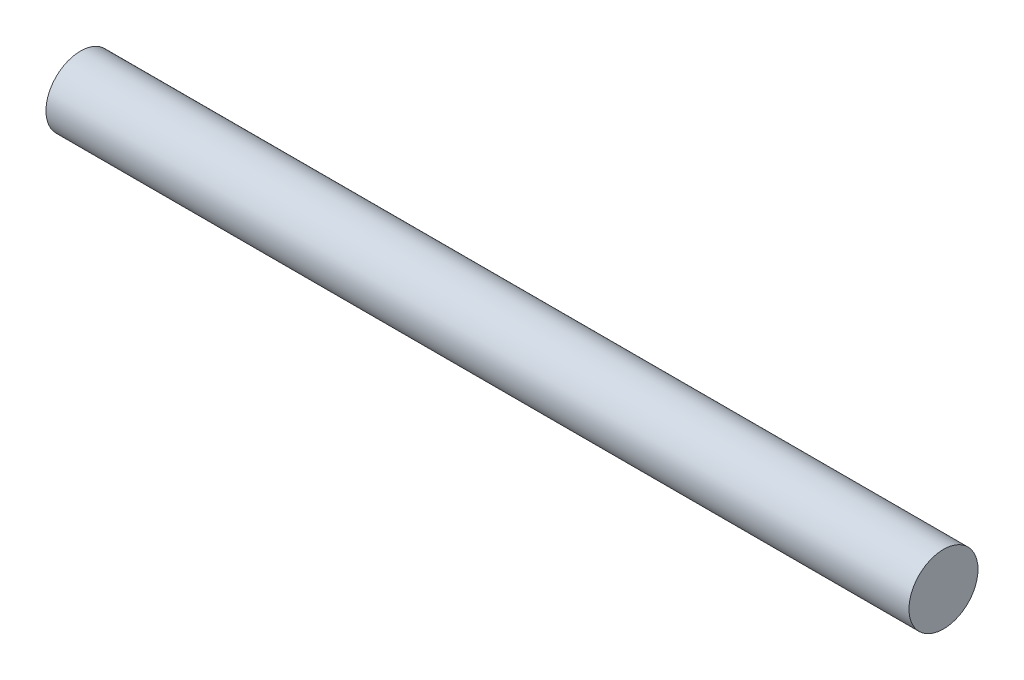
ISO-10303-21;
HEADER;
FILE_DESCRIPTION(('STEP AP214'),'2;1');
FILE_NAME('part.step','',(''),(''),'','','');
FILE_SCHEMA(('AUTOMOTIVE_DESIGN { 1 0 10303 214 1 1 1 1 }'));
ENDSEC;
DATA;
#1=APPLICATION_CONTEXT('core data for automotive mechanical design processes');
#2=APPLICATION_PROTOCOL_DEFINITION('international standard','automotive_design',2000,#1);
#3=PRODUCT_CONTEXT('',#1,'mechanical');
#4=PRODUCT('Part','Part','',(#3));
#5=PRODUCT_RELATED_PRODUCT_CATEGORY('part','',(#4));
#6=PRODUCT_DEFINITION_FORMATION('','',#4);
#7=PRODUCT_DEFINITION_CONTEXT('part definition',#1,'design');
#8=PRODUCT_DEFINITION('design','',#6,#7);
#9=PRODUCT_DEFINITION_SHAPE('','',#8);
#10=(LENGTH_UNIT() NAMED_UNIT(*) SI_UNIT(.MILLI.,.METRE.));
#11=(NAMED_UNIT(*) PLANE_ANGLE_UNIT() SI_UNIT($,.RADIAN.));
#12=(NAMED_UNIT(*) SI_UNIT($,.STERADIAN.) SOLID_ANGLE_UNIT());
#13=UNCERTAINTY_MEASURE_WITH_UNIT(LENGTH_MEASURE(1.E-05),#10,'distance_accuracy_value','');
#14=(GEOMETRIC_REPRESENTATION_CONTEXT(3) GLOBAL_UNCERTAINTY_ASSIGNED_CONTEXT((#13)) GLOBAL_UNIT_ASSIGNED_CONTEXT((#10,
#11,#12)) REPRESENTATION_CONTEXT('',''));
#15=CARTESIAN_POINT('',(0.,0.,0.));
#16=DIRECTION('',(0.,0.,1.));
#17=DIRECTION('',(1.,0.,0.));
#18=AXIS2_PLACEMENT_3D('',#15,#16,#17);
#19=CARTESIAN_POINT('',(20.,1.17889067490339,4.93660470115795));
#20=DIRECTION('',(-1.,0.,0.));
#21=DIRECTION('',(0.,0.,1.));
#22=AXIS2_PLACEMENT_3D('',#19,#20,#21);
#23=CYLINDRICAL_SURFACE('',#22,0.8);
#24=CARTESIAN_POINT('',(20.,1.17889067490339,4.93660470115795));
#25=DIRECTION('',(1.,0.,0.));
#26=DIRECTION('',(0.,0.,-1.));
#27=AXIS2_PLACEMENT_3D('',#24,#25,#26);
#28=CIRCLE('',#27,0.8);
#29=CARTESIAN_POINT('',(20.,1.17889067490339,4.13660470115795));
#30=VERTEX_POINT('',#29);
#31=EDGE_CURVE('E10',#30,#30,#28,.T.);
#32=ORIENTED_EDGE('',*,*,#31,.F.);
#33=EDGE_LOOP('',(#32));
#34=FACE_BOUND('',#33,.T.);
#35=CARTESIAN_POINT('',(0.,1.17889067490339,4.93660470115795));
#36=DIRECTION('',(1.,0.,0.));
#37=DIRECTION('',(0.,0.,-1.));
#38=AXIS2_PLACEMENT_3D('',#35,#36,#37);
#39=CIRCLE('',#38,0.8);
#40=CARTESIAN_POINT('',(0.,1.17889067490339,4.13660470115795));
#41=VERTEX_POINT('',#40);
#42=EDGE_CURVE('E34',#41,#41,#39,.T.);
#43=ORIENTED_EDGE('',*,*,#42,.T.);
#44=EDGE_LOOP('',(#43));
#45=FACE_BOUND('',#44,.T.);
#46=ADVANCED_FACE('F31',(#34,#45),#23,.T.);
#47=CARTESIAN_POINT('',(20.,1.17889067490339,4.93660470115795));
#48=DIRECTION('',(1.,0.,0.));
#49=DIRECTION('',(0.,0.,-1.));
#50=AXIS2_PLACEMENT_3D('',#47,#48,#49);
#51=PLANE('',#50);
#52=ORIENTED_EDGE('',*,*,#31,.T.);
#53=EDGE_LOOP('',(#52));
#54=FACE_BOUND('',#53,.T.);
#55=ADVANCED_FACE('F46',(#54),#51,.T.);
#56=CARTESIAN_POINT('',(0.,1.17889067490339,4.93660470115795));
#57=DIRECTION('',(1.,0.,0.));
#58=DIRECTION('',(0.,0.,-1.));
#59=AXIS2_PLACEMENT_3D('',#56,#57,#58);
#60=PLANE('',#59);
#61=ORIENTED_EDGE('',*,*,#42,.F.);
#62=EDGE_LOOP('',(#61));
#63=FACE_BOUND('',#62,.T.);
#64=ADVANCED_FACE('F44',(#63),#60,.F.);
#65=CLOSED_SHELL('',(#46,#55,#64));
#66=MANIFOLD_SOLID_BREP('B2',#65);
#67=ADVANCED_BREP_SHAPE_REPRESENTATION('',(#18,#66),#14);
#68=SHAPE_DEFINITION_REPRESENTATION(#9,#67);
ENDSEC;
END-ISO-10303-21;
